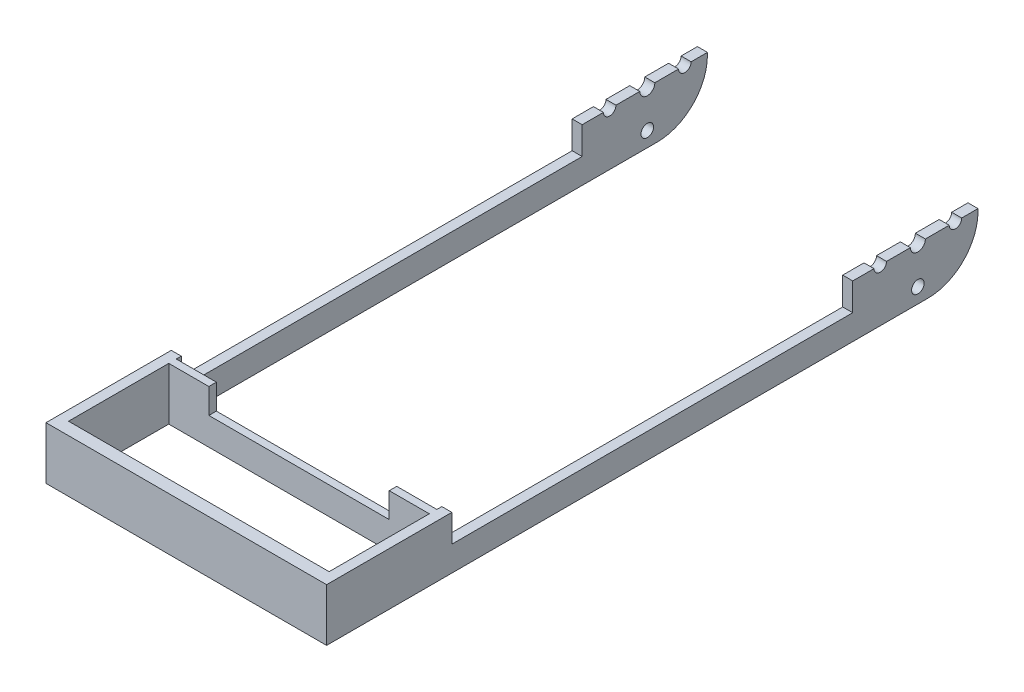
ISO-10303-21;
HEADER;
FILE_DESCRIPTION(('STEP AP214'),'2;1');
FILE_NAME('part.step','',(''),(''),'','','');
FILE_SCHEMA(('AUTOMOTIVE_DESIGN { 1 0 10303 214 1 1 1 1 }'));
ENDSEC;
DATA;
#1=APPLICATION_CONTEXT('core data for automotive mechanical design processes');
#2=APPLICATION_PROTOCOL_DEFINITION('international standard','automotive_design',2000,#1);
#3=PRODUCT_CONTEXT('',#1,'mechanical');
#4=PRODUCT('Part','Part','',(#3));
#5=PRODUCT_RELATED_PRODUCT_CATEGORY('part','',(#4));
#6=PRODUCT_DEFINITION_FORMATION('','',#4);
#7=PRODUCT_DEFINITION_CONTEXT('part definition',#1,'design');
#8=PRODUCT_DEFINITION('design','',#6,#7);
#9=PRODUCT_DEFINITION_SHAPE('','',#8);
#10=(LENGTH_UNIT() NAMED_UNIT(*) SI_UNIT(.MILLI.,.METRE.));
#11=(NAMED_UNIT(*) PLANE_ANGLE_UNIT() SI_UNIT($,.RADIAN.));
#12=(NAMED_UNIT(*) SI_UNIT($,.STERADIAN.) SOLID_ANGLE_UNIT());
#13=UNCERTAINTY_MEASURE_WITH_UNIT(LENGTH_MEASURE(1.E-05),#10,'distance_accuracy_value','');
#14=(GEOMETRIC_REPRESENTATION_CONTEXT(3) GLOBAL_UNCERTAINTY_ASSIGNED_CONTEXT((#13)) GLOBAL_UNIT_ASSIGNED_CONTEXT((#10,
#11,#12)) REPRESENTATION_CONTEXT('',''));
#15=CARTESIAN_POINT('',(0.,0.,0.));
#16=DIRECTION('',(0.,0.,1.));
#17=DIRECTION('',(1.,0.,0.));
#18=AXIS2_PLACEMENT_3D('',#15,#16,#17);
#19=CARTESIAN_POINT('',(0.,0.,0.));
#20=DIRECTION('',(0.,0.,1.));
#21=DIRECTION('',(1.,0.,0.));
#22=AXIS2_PLACEMENT_3D('',#19,#20,#21);
#23=PLANE('',#22);
#24=DIRECTION('',(0.,-1.,0.));
#25=VECTOR('',#24,1.);
#26=CARTESIAN_POINT('',(-28.,10.5,0.));
#27=LINE('',#26,#25);
#28=CARTESIAN_POINT('',(-28.,0.,0.));
#29=VERTEX_POINT('',#28);
#30=CARTESIAN_POINT('',(-28.,-0.499999999999994,0.));
#31=VERTEX_POINT('',#30);
#32=EDGE_CURVE('E309',#29,#31,#27,.T.);
#33=ORIENTED_EDGE('',*,*,#32,.F.);
#34=DIRECTION('',(1.,0.,0.));
#35=VECTOR('',#34,1.);
#36=CARTESIAN_POINT('',(0.,0.,0.));
#37=LINE('',#36,#35);
#38=CARTESIAN_POINT('',(-26.,0.,0.));
#39=VERTEX_POINT('',#38);
#40=EDGE_CURVE('E570',#29,#39,#37,.T.);
#41=ORIENTED_EDGE('',*,*,#40,.T.);
#42=DIRECTION('',(0.,-1.,0.));
#43=VECTOR('',#42,1.);
#44=CARTESIAN_POINT('',(-26.,10.5,0.));
#45=LINE('',#44,#43);
#46=CARTESIAN_POINT('',(-26.,-0.499999999999994,0.));
#47=VERTEX_POINT('',#46);
#48=EDGE_CURVE('E320',#39,#47,#45,.T.);
#49=ORIENTED_EDGE('',*,*,#48,.T.);
#50=DIRECTION('',(1.,0.,0.));
#51=VECTOR('',#50,1.);
#52=CARTESIAN_POINT('',(0.,-0.499999999999997,0.));
#53=LINE('',#52,#51);
#54=EDGE_CURVE('E358',#47,#31,#53,.F.);
#55=ORIENTED_EDGE('',*,*,#54,.T.);
#56=EDGE_LOOP('',(#33,#41,#49,#55));
#57=FACE_BOUND('',#56,.T.);
#58=ADVANCED_FACE('F33',(#57),#23,.F.);
#59=CARTESIAN_POINT('',(28.,10.5,130.));
#60=DIRECTION('',(-1.,0.,0.));
#61=DIRECTION('',(0.,0.,1.));
#62=AXIS2_PLACEMENT_3D('',#59,#60,#61);
#63=PLANE('',#62);
#64=DIRECTION('',(0.,1.,0.));
#65=VECTOR('',#64,1.);
#66=CARTESIAN_POINT('',(28.,10.5,0.));
#67=LINE('',#66,#65);
#68=CARTESIAN_POINT('',(28.,-0.499999999999994,0.));
#69=VERTEX_POINT('',#68);
#70=CARTESIAN_POINT('',(28.,0.,0.));
#71=VERTEX_POINT('',#70);
#72=EDGE_CURVE('E312',#69,#71,#67,.T.);
#73=ORIENTED_EDGE('',*,*,#72,.T.);
#74=DIRECTION('',(0.,0.,-1.));
#75=VECTOR('',#74,1.);
#76=CARTESIAN_POINT('',(28.,0.,-8.32851831252834));
#77=LINE('',#76,#75);
#78=CARTESIAN_POINT('',(28.,0.,3.25));
#79=VERTEX_POINT('',#78);
#80=EDGE_CURVE('E303',#79,#71,#77,.T.);
#81=ORIENTED_EDGE('',*,*,#80,.F.);
#82=CARTESIAN_POINT('',(28.,0.,4.5));
#83=DIRECTION('',(1.,0.,0.));
#84=DIRECTION('',(0.,0.,-1.));
#85=AXIS2_PLACEMENT_3D('',#82,#83,#84);
#86=CIRCLE('',#85,1.25);
#87=CARTESIAN_POINT('',(28.,0.,5.75));
#88=VERTEX_POINT('',#87);
#89=EDGE_CURVE('E447',#88,#79,#86,.T.);
#90=ORIENTED_EDGE('',*,*,#89,.F.);
#91=CARTESIAN_POINT('',(28.,0.,10.5));
#92=VERTEX_POINT('',#91);
#93=EDGE_CURVE('E700',#92,#88,#77,.T.);
#94=ORIENTED_EDGE('',*,*,#93,.F.);
#95=CARTESIAN_POINT('',(28.,0.,12.));
#96=DIRECTION('',(1.,0.,0.));
#97=DIRECTION('',(0.,0.,-1.));
#98=AXIS2_PLACEMENT_3D('',#95,#96,#97);
#99=CIRCLE('',#98,1.5);
#100=CARTESIAN_POINT('',(28.,0.,13.5));
#101=VERTEX_POINT('',#100);
#102=EDGE_CURVE('E446',#101,#92,#99,.T.);
#103=ORIENTED_EDGE('',*,*,#102,.F.);
#104=CARTESIAN_POINT('',(28.,0.,18.25));
#105=VERTEX_POINT('',#104);
#106=EDGE_CURVE('E704',#105,#101,#77,.T.);
#107=ORIENTED_EDGE('',*,*,#106,.F.);
#108=CARTESIAN_POINT('',(28.,0.,19.5));
#109=DIRECTION('',(1.,0.,0.));
#110=DIRECTION('',(0.,0.,1.));
#111=AXIS2_PLACEMENT_3D('',#108,#109,#110);
#112=CIRCLE('',#111,1.25);
#113=CARTESIAN_POINT('',(28.,0.,20.75));
#114=VERTEX_POINT('',#113);
#115=EDGE_CURVE('E440',#114,#105,#112,.T.);
#116=ORIENTED_EDGE('',*,*,#115,.F.);
#117=CARTESIAN_POINT('',(28.,0.,25.));
#118=VERTEX_POINT('',#117);
#119=EDGE_CURVE('E301',#118,#114,#77,.T.);
#120=ORIENTED_EDGE('',*,*,#119,.F.);
#121=DIRECTION('',(0.,1.,0.));
#122=VECTOR('',#121,1.);
#123=CARTESIAN_POINT('',(28.,4.5,25.));
#124=LINE('',#123,#122);
#125=CARTESIAN_POINT('',(28.,-5.5,25.));
#126=VERTEX_POINT('',#125);
#127=EDGE_CURVE('E399',#126,#118,#124,.T.);
#128=ORIENTED_EDGE('',*,*,#127,.F.);
#129=DIRECTION('',(0.,0.,-1.));
#130=VECTOR('',#129,1.);
#131=CARTESIAN_POINT('',(28.,-5.5,105.));
#132=LINE('',#131,#130);
#133=CARTESIAN_POINT('',(28.,-5.5,105.));
#134=VERTEX_POINT('',#133);
#135=EDGE_CURVE('E412',#134,#126,#132,.T.);
#136=ORIENTED_EDGE('',*,*,#135,.F.);
#137=DIRECTION('',(0.,-1.,0.));
#138=VECTOR('',#137,1.);
#139=CARTESIAN_POINT('',(28.,4.5,105.));
#140=LINE('',#139,#138);
#141=CARTESIAN_POINT('',(28.,0.,105.));
#142=VERTEX_POINT('',#141);
#143=EDGE_CURVE('E299',#142,#134,#140,.T.);
#144=ORIENTED_EDGE('',*,*,#143,.F.);
#145=CARTESIAN_POINT('',(28.,0.,130.));
#146=VERTEX_POINT('',#145);
#147=EDGE_CURVE('E280',#146,#142,#77,.T.);
#148=ORIENTED_EDGE('',*,*,#147,.F.);
#149=DIRECTION('',(0.,1.,0.));
#150=VECTOR('',#149,1.);
#151=CARTESIAN_POINT('',(28.,10.5,130.));
#152=LINE('',#151,#150);
#153=CARTESIAN_POINT('',(28.,-10.5,130.));
#154=VERTEX_POINT('',#153);
#155=EDGE_CURVE('E297',#154,#146,#152,.T.);
#156=ORIENTED_EDGE('',*,*,#155,.F.);
#157=DIRECTION('',(0.,0.,-1.));
#158=VECTOR('',#157,1.);
#159=CARTESIAN_POINT('',(28.,-10.5,130.));
#160=LINE('',#159,#158);
#161=CARTESIAN_POINT('',(28.,-10.5,9.99999999999999));
#162=VERTEX_POINT('',#161);
#163=EDGE_CURVE('E319',#154,#162,#160,.T.);
#164=ORIENTED_EDGE('',*,*,#163,.T.);
#165=CARTESIAN_POINT('',(28.,-0.499999999999997,9.99999999999999));
#166=DIRECTION('',(-1.,0.,0.));
#167=DIRECTION('',(0.,0.,1.));
#168=AXIS2_PLACEMENT_3D('',#165,#166,#167);
#169=CIRCLE('',#168,10.);
#170=EDGE_CURVE('E348',#162,#69,#169,.F.);
#171=ORIENTED_EDGE('',*,*,#170,.T.);
#172=EDGE_LOOP('',(#73,#81,#90,#94,#103,#107,#116,#120,#128,#136,#144,#148,#156,#164,#171));
#173=FACE_BOUND('',#172,.T.);
#174=CARTESIAN_POINT('',(28.,-7.5,12.));
#175=DIRECTION('',(1.,0.,0.));
#176=DIRECTION('',(0.,0.,1.));
#177=AXIS2_PLACEMENT_3D('',#174,#175,#176);
#178=CIRCLE('',#177,1.25);
#179=CARTESIAN_POINT('',(28.,-7.5,13.25));
#180=VERTEX_POINT('',#179);
#181=EDGE_CURVE('E436',#180,#180,#178,.T.);
#182=ORIENTED_EDGE('',*,*,#181,.F.);
#183=EDGE_LOOP('',(#182));
#184=FACE_BOUND('',#183,.T.);
#185=ADVANCED_FACE('F294',(#173,#184),#63,.F.);
#186=CARTESIAN_POINT('',(-28.,10.5,130.));
#187=DIRECTION('',(1.,0.,0.));
#188=DIRECTION('',(0.,1.,0.));
#189=AXIS2_PLACEMENT_3D('',#186,#187,#188);
#190=PLANE('',#189);
#191=DIRECTION('',(0.,-1.,0.));
#192=VECTOR('',#191,1.);
#193=CARTESIAN_POINT('',(-28.,10.5,130.));
#194=LINE('',#193,#192);
#195=CARTESIAN_POINT('',(-28.,0.,130.));
#196=VERTEX_POINT('',#195);
#197=CARTESIAN_POINT('',(-28.,-10.5,130.));
#198=VERTEX_POINT('',#197);
#199=EDGE_CURVE('E308',#196,#198,#194,.T.);
#200=ORIENTED_EDGE('',*,*,#199,.F.);
#201=DIRECTION('',(0.,0.,-1.));
#202=VECTOR('',#201,1.);
#203=CARTESIAN_POINT('',(-28.,0.,-9.87498970049028));
#204=LINE('',#203,#202);
#205=CARTESIAN_POINT('',(-28.,0.,105.));
#206=VERTEX_POINT('',#205);
#207=EDGE_CURVE('E283',#196,#206,#204,.T.);
#208=ORIENTED_EDGE('',*,*,#207,.T.);
#209=DIRECTION('',(0.,-1.,0.));
#210=VECTOR('',#209,1.);
#211=CARTESIAN_POINT('',(-28.,4.5,105.));
#212=LINE('',#211,#210);
#213=CARTESIAN_POINT('',(-28.,-5.5,105.));
#214=VERTEX_POINT('',#213);
#215=EDGE_CURVE('E411',#206,#214,#212,.T.);
#216=ORIENTED_EDGE('',*,*,#215,.T.);
#217=DIRECTION('',(0.,0.,-1.));
#218=VECTOR('',#217,1.);
#219=CARTESIAN_POINT('',(-28.,-5.5,105.));
#220=LINE('',#219,#218);
#221=CARTESIAN_POINT('',(-28.,-5.5,25.));
#222=VERTEX_POINT('',#221);
#223=EDGE_CURVE('E414',#214,#222,#220,.T.);
#224=ORIENTED_EDGE('',*,*,#223,.T.);
#225=DIRECTION('',(0.,1.,0.));
#226=VECTOR('',#225,1.);
#227=CARTESIAN_POINT('',(-28.,4.5,25.));
#228=LINE('',#227,#226);
#229=CARTESIAN_POINT('',(-28.,0.,25.));
#230=VERTEX_POINT('',#229);
#231=EDGE_CURVE('E408',#222,#230,#228,.T.);
#232=ORIENTED_EDGE('',*,*,#231,.T.);
#233=CARTESIAN_POINT('',(-28.,0.,20.75));
#234=VERTEX_POINT('',#233);
#235=EDGE_CURVE('E621',#230,#234,#204,.T.);
#236=ORIENTED_EDGE('',*,*,#235,.T.);
#237=CARTESIAN_POINT('',(-28.,0.,19.5));
#238=DIRECTION('',(1.,0.,0.));
#239=DIRECTION('',(0.,0.,1.));
#240=AXIS2_PLACEMENT_3D('',#237,#238,#239);
#241=CIRCLE('',#240,1.25);
#242=CARTESIAN_POINT('',(-28.,0.,18.25));
#243=VERTEX_POINT('',#242);
#244=EDGE_CURVE('E450',#234,#243,#241,.T.);
#245=ORIENTED_EDGE('',*,*,#244,.T.);
#246=CARTESIAN_POINT('',(-28.,0.,13.5));
#247=VERTEX_POINT('',#246);
#248=EDGE_CURVE('E623',#243,#247,#204,.T.);
#249=ORIENTED_EDGE('',*,*,#248,.T.);
#250=CARTESIAN_POINT('',(-28.,0.,12.));
#251=DIRECTION('',(1.,0.,0.));
#252=DIRECTION('',(0.,0.,-1.));
#253=AXIS2_PLACEMENT_3D('',#250,#251,#252);
#254=CIRCLE('',#253,1.5);
#255=CARTESIAN_POINT('',(-28.,0.,10.5));
#256=VERTEX_POINT('',#255);
#257=EDGE_CURVE('E331',#247,#256,#254,.T.);
#258=ORIENTED_EDGE('',*,*,#257,.T.);
#259=CARTESIAN_POINT('',(-28.,0.,5.75));
#260=VERTEX_POINT('',#259);
#261=EDGE_CURVE('E625',#256,#260,#204,.T.);
#262=ORIENTED_EDGE('',*,*,#261,.T.);
#263=CARTESIAN_POINT('',(-28.,0.,4.5));
#264=DIRECTION('',(1.,0.,0.));
#265=DIRECTION('',(0.,0.,-1.));
#266=AXIS2_PLACEMENT_3D('',#263,#264,#265);
#267=CIRCLE('',#266,1.25);
#268=CARTESIAN_POINT('',(-28.,0.,3.25));
#269=VERTEX_POINT('',#268);
#270=EDGE_CURVE('E443',#260,#269,#267,.T.);
#271=ORIENTED_EDGE('',*,*,#270,.T.);
#272=EDGE_CURVE('E300',#269,#29,#204,.T.);
#273=ORIENTED_EDGE('',*,*,#272,.T.);
#274=ORIENTED_EDGE('',*,*,#32,.T.);
#275=CARTESIAN_POINT('',(-28.,-0.499999999999997,9.99999999999999));
#276=DIRECTION('',(1.,0.,0.));
#277=DIRECTION('',(0.,1.,0.));
#278=AXIS2_PLACEMENT_3D('',#275,#276,#277);
#279=CIRCLE('',#278,10.);
#280=CARTESIAN_POINT('',(-28.,-10.5,9.99999999999999));
#281=VERTEX_POINT('',#280);
#282=EDGE_CURVE('E356',#31,#281,#279,.F.);
#283=ORIENTED_EDGE('',*,*,#282,.T.);
#284=DIRECTION('',(0.,0.,-1.));
#285=VECTOR('',#284,1.);
#286=CARTESIAN_POINT('',(-28.,-10.5,130.));
#287=LINE('',#286,#285);
#288=EDGE_CURVE('E323',#198,#281,#287,.T.);
#289=ORIENTED_EDGE('',*,*,#288,.F.);
#290=EDGE_LOOP('',(#200,#208,#216,#224,#232,#236,#245,#249,#258,#262,#271,#273,#274,#283,#289));
#291=FACE_BOUND('',#290,.T.);
#292=CARTESIAN_POINT('',(-28.,-7.5,12.));
#293=DIRECTION('',(1.,0.,0.));
#294=DIRECTION('',(0.,0.,1.));
#295=AXIS2_PLACEMENT_3D('',#292,#293,#294);
#296=CIRCLE('',#295,1.25);
#297=CARTESIAN_POINT('',(-28.,-7.5,13.25));
#298=VERTEX_POINT('',#297);
#299=EDGE_CURVE('E437',#298,#298,#296,.T.);
#300=ORIENTED_EDGE('',*,*,#299,.T.);
#301=EDGE_LOOP('',(#300));
#302=FACE_BOUND('',#301,.T.);
#303=ADVANCED_FACE('F617',(#291,#302),#190,.F.);
#304=CARTESIAN_POINT('',(-28.,-10.5,130.));
#305=DIRECTION('',(0.,1.,0.));
#306=DIRECTION('',(0.,0.,1.));
#307=AXIS2_PLACEMENT_3D('',#304,#305,#306);
#308=PLANE('',#307);
#309=DIRECTION('',(0.,0.,-1.));
#310=VECTOR('',#309,1.);
#311=CARTESIAN_POINT('',(-26.,-10.5,127.5));
#312=LINE('',#311,#310);
#313=CARTESIAN_POINT('',(-26.,-10.5,127.5));
#314=VERTEX_POINT('',#313);
#315=CARTESIAN_POINT('',(-26.,-10.5,107.5));
#316=VERTEX_POINT('',#315);
#317=EDGE_CURVE('E487',#314,#316,#312,.T.);
#318=ORIENTED_EDGE('',*,*,#317,.F.);
#319=DIRECTION('',(-1.,0.,0.));
#320=VECTOR('',#319,1.);
#321=CARTESIAN_POINT('',(26.,-10.5,127.5));
#322=LINE('',#321,#320);
#323=CARTESIAN_POINT('',(26.,-10.5,127.5));
#324=VERTEX_POINT('',#323);
#325=EDGE_CURVE('E467',#324,#314,#322,.T.);
#326=ORIENTED_EDGE('',*,*,#325,.F.);
#327=DIRECTION('',(0.,0.,1.));
#328=VECTOR('',#327,1.);
#329=CARTESIAN_POINT('',(26.,-10.5,107.5));
#330=LINE('',#329,#328);
#331=CARTESIAN_POINT('',(26.,-10.5,107.5));
#332=VERTEX_POINT('',#331);
#333=EDGE_CURVE('E493',#332,#324,#330,.T.);
#334=ORIENTED_EDGE('',*,*,#333,.F.);
#335=DIRECTION('',(1.,0.,0.));
#336=VECTOR('',#335,1.);
#337=CARTESIAN_POINT('',(-26.,-10.5,107.5));
#338=LINE('',#337,#336);
#339=EDGE_CURVE('E490',#316,#332,#338,.T.);
#340=ORIENTED_EDGE('',*,*,#339,.F.);
#341=EDGE_LOOP('',(#318,#326,#334,#340));
#342=FACE_BOUND('',#341,.T.);
#343=DIRECTION('',(0.,0.,1.));
#344=VECTOR('',#343,1.);
#345=CARTESIAN_POINT('',(26.,-10.5,0.));
#346=LINE('',#345,#344);
#347=CARTESIAN_POINT('',(26.,-10.5,9.99999999999999));
#348=VERTEX_POINT('',#347);
#349=CARTESIAN_POINT('',(26.,-10.5,106.));
#350=VERTEX_POINT('',#349);
#351=EDGE_CURVE('E468',#348,#350,#346,.T.);
#352=ORIENTED_EDGE('',*,*,#351,.F.);
#353=DIRECTION('',(1.,0.,0.));
#354=VECTOR('',#353,1.);
#355=CARTESIAN_POINT('',(-28.,-10.5,9.99999999999999));
#356=LINE('',#355,#354);
#357=EDGE_CURVE('E353',#348,#162,#356,.T.);
#358=ORIENTED_EDGE('',*,*,#357,.T.);
#359=ORIENTED_EDGE('',*,*,#163,.F.);
#360=DIRECTION('',(1.,0.,0.));
#361=VECTOR('',#360,1.);
#362=CARTESIAN_POINT('',(-28.,-10.5,130.));
#363=LINE('',#362,#361);
#364=EDGE_CURVE('E306',#198,#154,#363,.T.);
#365=ORIENTED_EDGE('',*,*,#364,.F.);
#366=ORIENTED_EDGE('',*,*,#288,.T.);
#367=DIRECTION('',(1.,0.,0.));
#368=VECTOR('',#367,1.);
#369=CARTESIAN_POINT('',(-28.,-10.5,9.99999999999999));
#370=LINE('',#369,#368);
#371=CARTESIAN_POINT('',(-26.,-10.5,9.99999999999999));
#372=VERTEX_POINT('',#371);
#373=EDGE_CURVE('E350',#281,#372,#370,.T.);
#374=ORIENTED_EDGE('',*,*,#373,.T.);
#375=DIRECTION('',(0.,0.,-1.));
#376=VECTOR('',#375,1.);
#377=CARTESIAN_POINT('',(-26.,-10.5,106.));
#378=LINE('',#377,#376);
#379=CARTESIAN_POINT('',(-26.,-10.5,106.));
#380=VERTEX_POINT('',#379);
#381=EDGE_CURVE('E475',#380,#372,#378,.T.);
#382=ORIENTED_EDGE('',*,*,#381,.F.);
#383=DIRECTION('',(-1.,0.,0.));
#384=VECTOR('',#383,1.);
#385=CARTESIAN_POINT('',(-26.,-10.5,106.));
#386=LINE('',#385,#384);
#387=EDGE_CURVE('E471',#350,#380,#386,.T.);
#388=ORIENTED_EDGE('',*,*,#387,.F.);
#389=EDGE_LOOP('',(#352,#358,#359,#365,#366,#374,#382,#388));
#390=FACE_BOUND('',#389,.T.);
#391=ADVANCED_FACE('F513',(#342,#390),#308,.F.);
#392=CARTESIAN_POINT('',(0.,0.,130.));
#393=DIRECTION('',(0.,0.,1.));
#394=DIRECTION('',(1.,0.,0.));
#395=AXIS2_PLACEMENT_3D('',#392,#393,#394);
#396=PLANE('',#395);
#397=DIRECTION('',(1.,0.,0.));
#398=VECTOR('',#397,1.);
#399=CARTESIAN_POINT('',(0.,0.,130.));
#400=LINE('',#399,#398);
#401=EDGE_CURVE('E277',#196,#146,#400,.T.);
#402=ORIENTED_EDGE('',*,*,#401,.F.);
#403=ORIENTED_EDGE('',*,*,#199,.T.);
#404=ORIENTED_EDGE('',*,*,#364,.T.);
#405=ORIENTED_EDGE('',*,*,#155,.T.);
#406=EDGE_LOOP('',(#402,#403,#404,#405));
#407=FACE_BOUND('',#406,.T.);
#408=ADVANCED_FACE('F304',(#407),#396,.T.);
#409=DIRECTION('',(0.,-1.,0.));
#410=VECTOR('',#409,1.);
#411=CARTESIAN_POINT('',(26.,10.5,0.));
#412=LINE('',#411,#410);
#413=CARTESIAN_POINT('',(26.,0.,0.));
#414=VERTEX_POINT('',#413);
#415=CARTESIAN_POINT('',(26.,-0.499999999999994,0.));
#416=VERTEX_POINT('',#415);
#417=EDGE_CURVE('E478',#414,#416,#412,.T.);
#418=ORIENTED_EDGE('',*,*,#417,.F.);
#419=DIRECTION('',(1.,0.,0.));
#420=VECTOR('',#419,1.);
#421=CARTESIAN_POINT('',(0.,0.,0.));
#422=LINE('',#421,#420);
#423=EDGE_CURVE('E588',#414,#71,#422,.T.);
#424=ORIENTED_EDGE('',*,*,#423,.T.);
#425=ORIENTED_EDGE('',*,*,#72,.F.);
#426=DIRECTION('',(1.,0.,0.));
#427=VECTOR('',#426,1.);
#428=CARTESIAN_POINT('',(0.,-0.499999999999997,0.));
#429=LINE('',#428,#427);
#430=EDGE_CURVE('E345',#69,#416,#429,.F.);
#431=ORIENTED_EDGE('',*,*,#430,.T.);
#432=EDGE_LOOP('',(#418,#424,#425,#431));
#433=FACE_BOUND('',#432,.T.);
#434=ADVANCED_FACE('F666',(#433),#23,.F.);
#435=CARTESIAN_POINT('',(-26.,10.5,106.));
#436=DIRECTION('',(-1.,0.,0.));
#437=DIRECTION('',(0.,0.,1.));
#438=AXIS2_PLACEMENT_3D('',#435,#436,#437);
#439=PLANE('',#438);
#440=ORIENTED_EDGE('',*,*,#48,.F.);
#441=DIRECTION('',(0.,0.,1.));
#442=VECTOR('',#441,1.);
#443=CARTESIAN_POINT('',(-26.,0.,106.));
#444=LINE('',#443,#442);
#445=CARTESIAN_POINT('',(-26.,0.,3.25));
#446=VERTEX_POINT('',#445);
#447=EDGE_CURVE('E569',#39,#446,#444,.T.);
#448=ORIENTED_EDGE('',*,*,#447,.T.);
#449=CARTESIAN_POINT('',(-26.,0.,4.5));
#450=DIRECTION('',(-1.,0.,0.));
#451=DIRECTION('',(0.,0.,1.));
#452=AXIS2_PLACEMENT_3D('',#449,#450,#451);
#453=CIRCLE('',#452,1.25);
#454=CARTESIAN_POINT('',(-26.,0.,5.75));
#455=VERTEX_POINT('',#454);
#456=EDGE_CURVE('E343',#446,#455,#453,.T.);
#457=ORIENTED_EDGE('',*,*,#456,.T.);
#458=CARTESIAN_POINT('',(-26.,0.,10.5));
#459=VERTEX_POINT('',#458);
#460=EDGE_CURVE('E562',#455,#459,#444,.T.);
#461=ORIENTED_EDGE('',*,*,#460,.T.);
#462=CARTESIAN_POINT('',(-26.,0.,12.));
#463=DIRECTION('',(-1.,0.,0.));
#464=DIRECTION('',(0.,0.,1.));
#465=AXIS2_PLACEMENT_3D('',#462,#463,#464);
#466=CIRCLE('',#465,1.5);
#467=CARTESIAN_POINT('',(-26.,0.,13.5));
#468=VERTEX_POINT('',#467);
#469=EDGE_CURVE('E330',#459,#468,#466,.T.);
#470=ORIENTED_EDGE('',*,*,#469,.T.);
#471=CARTESIAN_POINT('',(-26.,0.,18.25));
#472=VERTEX_POINT('',#471);
#473=EDGE_CURVE('E543',#468,#472,#444,.T.);
#474=ORIENTED_EDGE('',*,*,#473,.T.);
#475=CARTESIAN_POINT('',(-26.,0.,19.5));
#476=DIRECTION('',(-1.,0.,0.));
#477=DIRECTION('',(0.,0.,1.));
#478=AXIS2_PLACEMENT_3D('',#475,#476,#477);
#479=CIRCLE('',#478,1.25);
#480=CARTESIAN_POINT('',(-26.,0.,20.75));
#481=VERTEX_POINT('',#480);
#482=EDGE_CURVE('E339',#472,#481,#479,.T.);
#483=ORIENTED_EDGE('',*,*,#482,.T.);
#484=CARTESIAN_POINT('',(-26.,0.,25.));
#485=VERTEX_POINT('',#484);
#486=EDGE_CURVE('E544',#481,#485,#444,.T.);
#487=ORIENTED_EDGE('',*,*,#486,.T.);
#488=DIRECTION('',(0.,-1.,0.));
#489=VECTOR('',#488,1.);
#490=CARTESIAN_POINT('',(-26.,10.5,25.));
#491=LINE('',#490,#489);
#492=CARTESIAN_POINT('',(-26.,-5.5,25.));
#493=VERTEX_POINT('',#492);
#494=EDGE_CURVE('E434',#485,#493,#491,.T.);
#495=ORIENTED_EDGE('',*,*,#494,.T.);
#496=DIRECTION('',(0.,0.,1.));
#497=VECTOR('',#496,1.);
#498=CARTESIAN_POINT('',(-26.,-5.5,106.));
#499=LINE('',#498,#497);
#500=CARTESIAN_POINT('',(-26.,-5.5,105.));
#501=VERTEX_POINT('',#500);
#502=EDGE_CURVE('E431',#493,#501,#499,.T.);
#503=ORIENTED_EDGE('',*,*,#502,.T.);
#504=DIRECTION('',(0.,1.,0.));
#505=VECTOR('',#504,1.);
#506=CARTESIAN_POINT('',(-26.,10.5,105.));
#507=LINE('',#506,#505);
#508=CARTESIAN_POINT('',(-26.,0.,105.));
#509=VERTEX_POINT('',#508);
#510=EDGE_CURVE('E424',#501,#509,#507,.T.);
#511=ORIENTED_EDGE('',*,*,#510,.T.);
#512=CARTESIAN_POINT('',(-26.,0.,106.));
#513=VERTEX_POINT('',#512);
#514=EDGE_CURVE('E539',#509,#513,#444,.T.);
#515=ORIENTED_EDGE('',*,*,#514,.T.);
#516=DIRECTION('',(0.,-1.,0.));
#517=VECTOR('',#516,1.);
#518=CARTESIAN_POINT('',(-26.,10.5,106.));
#519=LINE('',#518,#517);
#520=EDGE_CURVE('E480',#513,#380,#519,.T.);
#521=ORIENTED_EDGE('',*,*,#520,.T.);
#522=ORIENTED_EDGE('',*,*,#381,.T.);
#523=CARTESIAN_POINT('',(-26.,-0.499999999999997,9.99999999999999));
#524=DIRECTION('',(-1.,0.,0.));
#525=DIRECTION('',(0.,0.,1.));
#526=AXIS2_PLACEMENT_3D('',#523,#524,#525);
#527=CIRCLE('',#526,10.);
#528=EDGE_CURVE('E361',#372,#47,#527,.F.);
#529=ORIENTED_EDGE('',*,*,#528,.T.);
#530=EDGE_LOOP('',(#440,#448,#457,#461,#470,#474,#483,#487,#495,#503,#511,#515,#521,#522,#529));
#531=FACE_BOUND('',#530,.T.);
#532=CARTESIAN_POINT('',(-26.,-7.5,12.));
#533=DIRECTION('',(-1.,0.,0.));
#534=DIRECTION('',(0.,0.,1.));
#535=AXIS2_PLACEMENT_3D('',#532,#533,#534);
#536=CIRCLE('',#535,1.25);
#537=CARTESIAN_POINT('',(-26.,-7.5,13.25));
#538=VERTEX_POINT('',#537);
#539=EDGE_CURVE('E335',#538,#538,#536,.T.);
#540=ORIENTED_EDGE('',*,*,#539,.T.);
#541=EDGE_LOOP('',(#540));
#542=FACE_BOUND('',#541,.T.);
#543=ADVANCED_FACE('F605',(#531,#542),#439,.F.);
#544=CARTESIAN_POINT('',(-26.,10.5,106.));
#545=DIRECTION('',(0.,0.,1.));
#546=DIRECTION('',(1.,0.,0.));
#547=AXIS2_PLACEMENT_3D('',#544,#545,#546);
#548=PLANE('',#547);
#549=ORIENTED_EDGE('',*,*,#520,.F.);
#550=DIRECTION('',(1.,0.,0.));
#551=VECTOR('',#550,1.);
#552=CARTESIAN_POINT('',(-26.,0.,106.));
#553=LINE('',#552,#551);
#554=CARTESIAN_POINT('',(-18.,0.,106.));
#555=VERTEX_POINT('',#554);
#556=EDGE_CURVE('E530',#513,#555,#553,.T.);
#557=ORIENTED_EDGE('',*,*,#556,.T.);
#558=DIRECTION('',(0.,1.,0.));
#559=VECTOR('',#558,1.);
#560=CARTESIAN_POINT('',(-18.,5.,106.));
#561=LINE('',#560,#559);
#562=CARTESIAN_POINT('',(-18.,-5.,106.));
#563=VERTEX_POINT('',#562);
#564=EDGE_CURVE('E287',#563,#555,#561,.T.);
#565=ORIENTED_EDGE('',*,*,#564,.F.);
#566=DIRECTION('',(-1.,0.,0.));
#567=VECTOR('',#566,1.);
#568=CARTESIAN_POINT('',(18.,-5.,106.));
#569=LINE('',#568,#567);
#570=CARTESIAN_POINT('',(18.,-5.,106.));
#571=VERTEX_POINT('',#570);
#572=EDGE_CURVE('E397',#571,#563,#569,.T.);
#573=ORIENTED_EDGE('',*,*,#572,.F.);
#574=DIRECTION('',(0.,-1.,0.));
#575=VECTOR('',#574,1.);
#576=CARTESIAN_POINT('',(18.,5.,106.));
#577=LINE('',#576,#575);
#578=CARTESIAN_POINT('',(18.,0.,106.));
#579=VERTEX_POINT('',#578);
#580=EDGE_CURVE('E595',#579,#571,#577,.T.);
#581=ORIENTED_EDGE('',*,*,#580,.F.);
#582=CARTESIAN_POINT('',(26.,0.,106.));
#583=VERTEX_POINT('',#582);
#584=EDGE_CURVE('E524',#579,#583,#553,.T.);
#585=ORIENTED_EDGE('',*,*,#584,.T.);
#586=DIRECTION('',(0.,-1.,0.));
#587=VECTOR('',#586,1.);
#588=CARTESIAN_POINT('',(26.,10.5,106.));
#589=LINE('',#588,#587);
#590=EDGE_CURVE('E482',#583,#350,#589,.T.);
#591=ORIENTED_EDGE('',*,*,#590,.T.);
#592=ORIENTED_EDGE('',*,*,#387,.T.);
#593=EDGE_LOOP('',(#549,#557,#565,#573,#581,#585,#591,#592));
#594=FACE_BOUND('',#593,.T.);
#595=ADVANCED_FACE('F601',(#594),#548,.F.);
#596=CARTESIAN_POINT('',(26.,10.5,0.));
#597=DIRECTION('',(1.,0.,0.));
#598=DIRECTION('',(0.,0.,-1.));
#599=AXIS2_PLACEMENT_3D('',#596,#597,#598);
#600=PLANE('',#599);
#601=ORIENTED_EDGE('',*,*,#590,.F.);
#602=DIRECTION('',(0.,0.,-1.));
#603=VECTOR('',#602,1.);
#604=CARTESIAN_POINT('',(26.,0.,0.));
#605=LINE('',#604,#603);
#606=CARTESIAN_POINT('',(26.,0.,105.));
#607=VERTEX_POINT('',#606);
#608=EDGE_CURVE('E532',#583,#607,#605,.T.);
#609=ORIENTED_EDGE('',*,*,#608,.T.);
#610=DIRECTION('',(0.,-1.,0.));
#611=VECTOR('',#610,1.);
#612=CARTESIAN_POINT('',(26.,10.5,105.));
#613=LINE('',#612,#611);
#614=CARTESIAN_POINT('',(26.,-5.5,105.));
#615=VERTEX_POINT('',#614);
#616=EDGE_CURVE('E364',#607,#615,#613,.T.);
#617=ORIENTED_EDGE('',*,*,#616,.T.);
#618=DIRECTION('',(0.,0.,-1.));
#619=VECTOR('',#618,1.);
#620=CARTESIAN_POINT('',(26.,-5.5,0.));
#621=LINE('',#620,#619);
#622=CARTESIAN_POINT('',(26.,-5.5,25.));
#623=VERTEX_POINT('',#622);
#624=EDGE_CURVE('E366',#615,#623,#621,.T.);
#625=ORIENTED_EDGE('',*,*,#624,.T.);
#626=DIRECTION('',(0.,1.,0.));
#627=VECTOR('',#626,1.);
#628=CARTESIAN_POINT('',(26.,10.5,25.));
#629=LINE('',#628,#627);
#630=CARTESIAN_POINT('',(26.,0.,25.));
#631=VERTEX_POINT('',#630);
#632=EDGE_CURVE('E369',#623,#631,#629,.T.);
#633=ORIENTED_EDGE('',*,*,#632,.T.);
#634=CARTESIAN_POINT('',(26.,0.,20.75));
#635=VERTEX_POINT('',#634);
#636=EDGE_CURVE('E535',#631,#635,#605,.T.);
#637=ORIENTED_EDGE('',*,*,#636,.T.);
#638=CARTESIAN_POINT('',(26.,0.,19.5));
#639=DIRECTION('',(1.,0.,0.));
#640=DIRECTION('',(0.,0.,-1.));
#641=AXIS2_PLACEMENT_3D('',#638,#639,#640);
#642=CIRCLE('',#641,1.25);
#643=CARTESIAN_POINT('',(26.,0.,18.25));
#644=VERTEX_POINT('',#643);
#645=EDGE_CURVE('E336',#635,#644,#642,.T.);
#646=ORIENTED_EDGE('',*,*,#645,.T.);
#647=CARTESIAN_POINT('',(26.,0.,13.5));
#648=VERTEX_POINT('',#647);
#649=EDGE_CURVE('E48',#644,#648,#605,.T.);
#650=ORIENTED_EDGE('',*,*,#649,.T.);
#651=CARTESIAN_POINT('',(26.,0.,12.));
#652=DIRECTION('',(1.,0.,0.));
#653=DIRECTION('',(0.,0.,-1.));
#654=AXIS2_PLACEMENT_3D('',#651,#652,#653);
#655=CIRCLE('',#654,1.5);
#656=CARTESIAN_POINT('',(26.,0.,10.5));
#657=VERTEX_POINT('',#656);
#658=EDGE_CURVE('E327',#648,#657,#655,.T.);
#659=ORIENTED_EDGE('',*,*,#658,.T.);
#660=CARTESIAN_POINT('',(26.,0.,5.75));
#661=VERTEX_POINT('',#660);
#662=EDGE_CURVE('E582',#657,#661,#605,.T.);
#663=ORIENTED_EDGE('',*,*,#662,.T.);
#664=CARTESIAN_POINT('',(26.,0.,4.5));
#665=DIRECTION('',(1.,0.,0.));
#666=DIRECTION('',(0.,0.,-1.));
#667=AXIS2_PLACEMENT_3D('',#664,#665,#666);
#668=CIRCLE('',#667,1.25);
#669=CARTESIAN_POINT('',(26.,0.,3.25));
#670=VERTEX_POINT('',#669);
#671=EDGE_CURVE('E340',#661,#670,#668,.T.);
#672=ORIENTED_EDGE('',*,*,#671,.T.);
#673=EDGE_CURVE('E56',#670,#414,#605,.T.);
#674=ORIENTED_EDGE('',*,*,#673,.T.);
#675=ORIENTED_EDGE('',*,*,#417,.T.);
#676=CARTESIAN_POINT('',(26.,-0.499999999999997,9.99999999999999));
#677=DIRECTION('',(1.,0.,0.));
#678=DIRECTION('',(0.,0.,-1.));
#679=AXIS2_PLACEMENT_3D('',#676,#677,#678);
#680=CIRCLE('',#679,10.);
#681=EDGE_CURVE('E326',#416,#348,#680,.F.);
#682=ORIENTED_EDGE('',*,*,#681,.T.);
#683=ORIENTED_EDGE('',*,*,#351,.T.);
#684=EDGE_LOOP('',(#601,#609,#617,#625,#633,#637,#646,#650,#659,#663,#672,#674,#675,#682,#683));
#685=FACE_BOUND('',#684,.T.);
#686=CARTESIAN_POINT('',(26.,-7.5,12.));
#687=DIRECTION('',(1.,0.,0.));
#688=DIRECTION('',(0.,0.,-1.));
#689=AXIS2_PLACEMENT_3D('',#686,#687,#688);
#690=CIRCLE('',#689,1.25);
#691=CARTESIAN_POINT('',(26.,-7.5,10.75));
#692=VERTEX_POINT('',#691);
#693=EDGE_CURVE('E332',#692,#692,#690,.T.);
#694=ORIENTED_EDGE('',*,*,#693,.T.);
#695=EDGE_LOOP('',(#694));
#696=FACE_BOUND('',#695,.T.);
#697=ADVANCED_FACE('F686',(#685,#696),#600,.F.);
#698=CARTESIAN_POINT('',(26.,10.5,127.5));
#699=DIRECTION('',(0.,0.,1.));
#700=DIRECTION('',(1.,0.,0.));
#701=AXIS2_PLACEMENT_3D('',#698,#699,#700);
#702=PLANE('',#701);
#703=DIRECTION('',(0.,-1.,0.));
#704=VECTOR('',#703,1.);
#705=CARTESIAN_POINT('',(-26.,10.5,127.5));
#706=LINE('',#705,#704);
#707=CARTESIAN_POINT('',(-26.,0.,127.5));
#708=VERTEX_POINT('',#707);
#709=EDGE_CURVE('E315',#708,#314,#706,.T.);
#710=ORIENTED_EDGE('',*,*,#709,.F.);
#711=DIRECTION('',(1.,0.,0.));
#712=VECTOR('',#711,1.);
#713=CARTESIAN_POINT('',(26.,0.,127.5));
#714=LINE('',#713,#712);
#715=CARTESIAN_POINT('',(26.,0.,127.5));
#716=VERTEX_POINT('',#715);
#717=EDGE_CURVE('E522',#708,#716,#714,.T.);
#718=ORIENTED_EDGE('',*,*,#717,.T.);
#719=DIRECTION('',(0.,-1.,0.));
#720=VECTOR('',#719,1.);
#721=CARTESIAN_POINT('',(26.,10.5,127.5));
#722=LINE('',#721,#720);
#723=EDGE_CURVE('E472',#716,#324,#722,.T.);
#724=ORIENTED_EDGE('',*,*,#723,.T.);
#725=ORIENTED_EDGE('',*,*,#325,.T.);
#726=EDGE_LOOP('',(#710,#718,#724,#725));
#727=FACE_BOUND('',#726,.T.);
#728=ADVANCED_FACE('F509',(#727),#702,.F.);
#729=CARTESIAN_POINT('',(26.,10.5,107.5));
#730=DIRECTION('',(1.,0.,0.));
#731=DIRECTION('',(0.,0.,-1.));
#732=AXIS2_PLACEMENT_3D('',#729,#730,#731);
#733=PLANE('',#732);
#734=ORIENTED_EDGE('',*,*,#723,.F.);
#735=DIRECTION('',(0.,0.,-1.));
#736=VECTOR('',#735,1.);
#737=CARTESIAN_POINT('',(26.,0.,107.5));
#738=LINE('',#737,#736);
#739=CARTESIAN_POINT('',(26.,0.,107.5));
#740=VERTEX_POINT('',#739);
#741=EDGE_CURVE('E521',#716,#740,#738,.T.);
#742=ORIENTED_EDGE('',*,*,#741,.T.);
#743=DIRECTION('',(0.,-1.,0.));
#744=VECTOR('',#743,1.);
#745=CARTESIAN_POINT('',(26.,10.5,107.5));
#746=LINE('',#745,#744);
#747=EDGE_CURVE('E497',#740,#332,#746,.T.);
#748=ORIENTED_EDGE('',*,*,#747,.T.);
#749=ORIENTED_EDGE('',*,*,#333,.T.);
#750=EDGE_LOOP('',(#734,#742,#748,#749));
#751=FACE_BOUND('',#750,.T.);
#752=ADVANCED_FACE('F520',(#751),#733,.F.);
#753=CARTESIAN_POINT('',(-26.,10.5,107.5));
#754=DIRECTION('',(0.,0.,-1.));
#755=DIRECTION('',(-1.,0.,0.));
#756=AXIS2_PLACEMENT_3D('',#753,#754,#755);
#757=PLANE('',#756);
#758=ORIENTED_EDGE('',*,*,#747,.F.);
#759=DIRECTION('',(-1.,0.,0.));
#760=VECTOR('',#759,1.);
#761=CARTESIAN_POINT('',(-26.,0.,107.5));
#762=LINE('',#761,#760);
#763=CARTESIAN_POINT('',(18.,0.,107.5));
#764=VERTEX_POINT('',#763);
#765=EDGE_CURVE('E516',#740,#764,#762,.T.);
#766=ORIENTED_EDGE('',*,*,#765,.T.);
#767=DIRECTION('',(0.,-1.,0.));
#768=VECTOR('',#767,1.);
#769=CARTESIAN_POINT('',(18.,10.5,107.5));
#770=LINE('',#769,#768);
#771=CARTESIAN_POINT('',(18.,-5.,107.5));
#772=VERTEX_POINT('',#771);
#773=EDGE_CURVE('E372',#764,#772,#770,.T.);
#774=ORIENTED_EDGE('',*,*,#773,.T.);
#775=DIRECTION('',(-1.,0.,0.));
#776=VECTOR('',#775,1.);
#777=CARTESIAN_POINT('',(-26.,-5.,107.5));
#778=LINE('',#777,#776);
#779=CARTESIAN_POINT('',(-18.,-5.,107.5));
#780=VERTEX_POINT('',#779);
#781=EDGE_CURVE('E374',#772,#780,#778,.T.);
#782=ORIENTED_EDGE('',*,*,#781,.T.);
#783=DIRECTION('',(0.,1.,0.));
#784=VECTOR('',#783,1.);
#785=CARTESIAN_POINT('',(-18.,10.5,107.5));
#786=LINE('',#785,#784);
#787=CARTESIAN_POINT('',(-18.,0.,107.5));
#788=VERTEX_POINT('',#787);
#789=EDGE_CURVE('E41',#780,#788,#786,.T.);
#790=ORIENTED_EDGE('',*,*,#789,.T.);
#791=CARTESIAN_POINT('',(-26.,0.,107.5));
#792=VERTEX_POINT('',#791);
#793=EDGE_CURVE('E381',#788,#792,#762,.T.);
#794=ORIENTED_EDGE('',*,*,#793,.T.);
#795=DIRECTION('',(0.,-1.,0.));
#796=VECTOR('',#795,1.);
#797=CARTESIAN_POINT('',(-26.,10.5,107.5));
#798=LINE('',#797,#796);
#799=EDGE_CURVE('E498',#792,#316,#798,.T.);
#800=ORIENTED_EDGE('',*,*,#799,.T.);
#801=ORIENTED_EDGE('',*,*,#339,.T.);
#802=EDGE_LOOP('',(#758,#766,#774,#782,#790,#794,#800,#801));
#803=FACE_BOUND('',#802,.T.);
#804=ADVANCED_FACE('F380',(#803),#757,.F.);
#805=CARTESIAN_POINT('',(-26.,10.5,127.5));
#806=DIRECTION('',(-1.,0.,0.));
#807=DIRECTION('',(0.,0.,1.));
#808=AXIS2_PLACEMENT_3D('',#805,#806,#807);
#809=PLANE('',#808);
#810=ORIENTED_EDGE('',*,*,#799,.F.);
#811=DIRECTION('',(0.,0.,1.));
#812=VECTOR('',#811,1.);
#813=CARTESIAN_POINT('',(-26.,0.,127.5));
#814=LINE('',#813,#812);
#815=EDGE_CURVE('E505',#792,#708,#814,.T.);
#816=ORIENTED_EDGE('',*,*,#815,.T.);
#817=ORIENTED_EDGE('',*,*,#709,.T.);
#818=ORIENTED_EDGE('',*,*,#317,.T.);
#819=EDGE_LOOP('',(#810,#816,#817,#818));
#820=FACE_BOUND('',#819,.T.);
#821=ADVANCED_FACE('F502',(#820),#809,.F.);
#822=CARTESIAN_POINT('',(-28.,0.,12.));
#823=DIRECTION('',(1.,0.,0.));
#824=DIRECTION('',(0.,0.,-1.));
#825=AXIS2_PLACEMENT_3D('',#822,#823,#824);
#826=CYLINDRICAL_SURFACE('',#825,1.5);
#827=ORIENTED_EDGE('',*,*,#102,.T.);
#828=DIRECTION('',(1.,0.,0.));
#829=VECTOR('',#828,1.);
#830=CARTESIAN_POINT('',(-28.,0.,10.5));
#831=LINE('',#830,#829);
#832=EDGE_CURVE('E583',#92,#657,#831,.F.);
#833=ORIENTED_EDGE('',*,*,#832,.T.);
#834=ORIENTED_EDGE('',*,*,#658,.F.);
#835=DIRECTION('',(1.,0.,0.));
#836=VECTOR('',#835,1.);
#837=CARTESIAN_POINT('',(-28.,0.,13.5));
#838=LINE('',#837,#836);
#839=EDGE_CURVE('E288',#648,#101,#838,.T.);
#840=ORIENTED_EDGE('',*,*,#839,.T.);
#841=EDGE_LOOP('',(#827,#833,#834,#840));
#842=FACE_BOUND('',#841,.T.);
#843=ADVANCED_FACE('F695',(#842),#826,.F.);
#844=CARTESIAN_POINT('',(-28.,-7.5,12.));
#845=DIRECTION('',(1.,0.,0.));
#846=DIRECTION('',(0.,0.,-1.));
#847=AXIS2_PLACEMENT_3D('',#844,#845,#846);
#848=CYLINDRICAL_SURFACE('',#847,1.25);
#849=ORIENTED_EDGE('',*,*,#181,.T.);
#850=EDGE_LOOP('',(#849));
#851=FACE_BOUND('',#850,.T.);
#852=ORIENTED_EDGE('',*,*,#693,.F.);
#853=EDGE_LOOP('',(#852));
#854=FACE_BOUND('',#853,.T.);
#855=ADVANCED_FACE('F718',(#851,#854),#848,.F.);
#856=CARTESIAN_POINT('',(-28.,0.,19.5));
#857=DIRECTION('',(1.,0.,0.));
#858=DIRECTION('',(0.,0.,-1.));
#859=AXIS2_PLACEMENT_3D('',#856,#857,#858);
#860=CYLINDRICAL_SURFACE('',#859,1.25);
#861=ORIENTED_EDGE('',*,*,#115,.T.);
#862=DIRECTION('',(1.,0.,0.));
#863=VECTOR('',#862,1.);
#864=CARTESIAN_POINT('',(-28.,0.,18.25));
#865=LINE('',#864,#863);
#866=EDGE_CURVE('E591',#105,#644,#865,.F.);
#867=ORIENTED_EDGE('',*,*,#866,.T.);
#868=ORIENTED_EDGE('',*,*,#645,.F.);
#869=DIRECTION('',(1.,0.,0.));
#870=VECTOR('',#869,1.);
#871=CARTESIAN_POINT('',(-28.,0.,20.75));
#872=LINE('',#871,#870);
#873=EDGE_CURVE('E556',#635,#114,#872,.T.);
#874=ORIENTED_EDGE('',*,*,#873,.T.);
#875=EDGE_LOOP('',(#861,#867,#868,#874));
#876=FACE_BOUND('',#875,.T.);
#877=ADVANCED_FACE('F709',(#876),#860,.F.);
#878=CARTESIAN_POINT('',(-28.,0.,4.5));
#879=DIRECTION('',(1.,0.,0.));
#880=DIRECTION('',(0.,0.,-1.));
#881=AXIS2_PLACEMENT_3D('',#878,#879,#880);
#882=CYLINDRICAL_SURFACE('',#881,1.25);
#883=ORIENTED_EDGE('',*,*,#89,.T.);
#884=DIRECTION('',(1.,0.,0.));
#885=VECTOR('',#884,1.);
#886=CARTESIAN_POINT('',(-28.,0.,3.25));
#887=LINE('',#886,#885);
#888=EDGE_CURVE('E586',#79,#670,#887,.F.);
#889=ORIENTED_EDGE('',*,*,#888,.T.);
#890=ORIENTED_EDGE('',*,*,#671,.F.);
#891=DIRECTION('',(1.,0.,0.));
#892=VECTOR('',#891,1.);
#893=CARTESIAN_POINT('',(-28.,0.,5.75));
#894=LINE('',#893,#892);
#895=EDGE_CURVE('E579',#661,#88,#894,.T.);
#896=ORIENTED_EDGE('',*,*,#895,.T.);
#897=EDGE_LOOP('',(#883,#889,#890,#896));
#898=FACE_BOUND('',#897,.T.);
#899=ADVANCED_FACE('F707',(#898),#882,.F.);
#900=ORIENTED_EDGE('',*,*,#469,.F.);
#901=DIRECTION('',(1.,0.,0.));
#902=VECTOR('',#901,1.);
#903=CARTESIAN_POINT('',(-28.,0.,10.5));
#904=LINE('',#903,#902);
#905=EDGE_CURVE('E563',#459,#256,#904,.F.);
#906=ORIENTED_EDGE('',*,*,#905,.T.);
#907=ORIENTED_EDGE('',*,*,#257,.F.);
#908=DIRECTION('',(1.,0.,0.));
#909=VECTOR('',#908,1.);
#910=CARTESIAN_POINT('',(-28.,0.,13.5));
#911=LINE('',#910,#909);
#912=EDGE_CURVE('E576',#247,#468,#911,.T.);
#913=ORIENTED_EDGE('',*,*,#912,.T.);
#914=EDGE_LOOP('',(#900,#906,#907,#913));
#915=FACE_BOUND('',#914,.T.);
#916=ADVANCED_FACE('F635',(#915),#826,.F.);
#917=ORIENTED_EDGE('',*,*,#299,.F.);
#918=EDGE_LOOP('',(#917));
#919=FACE_BOUND('',#918,.T.);
#920=ORIENTED_EDGE('',*,*,#539,.F.);
#921=EDGE_LOOP('',(#920));
#922=FACE_BOUND('',#921,.T.);
#923=ADVANCED_FACE('F716',(#919,#922),#848,.F.);
#924=ORIENTED_EDGE('',*,*,#482,.F.);
#925=DIRECTION('',(1.,0.,0.));
#926=VECTOR('',#925,1.);
#927=CARTESIAN_POINT('',(-28.,0.,18.25));
#928=LINE('',#927,#926);
#929=EDGE_CURVE('E573',#472,#243,#928,.F.);
#930=ORIENTED_EDGE('',*,*,#929,.T.);
#931=ORIENTED_EDGE('',*,*,#244,.F.);
#932=DIRECTION('',(1.,0.,0.));
#933=VECTOR('',#932,1.);
#934=CARTESIAN_POINT('',(-28.,0.,20.75));
#935=LINE('',#934,#933);
#936=EDGE_CURVE('E550',#234,#481,#935,.T.);
#937=ORIENTED_EDGE('',*,*,#936,.T.);
#938=EDGE_LOOP('',(#924,#930,#931,#937));
#939=FACE_BOUND('',#938,.T.);
#940=ADVANCED_FACE('F645',(#939),#860,.F.);
#941=ORIENTED_EDGE('',*,*,#456,.F.);
#942=DIRECTION('',(1.,0.,0.));
#943=VECTOR('',#942,1.);
#944=CARTESIAN_POINT('',(-28.,0.,3.25));
#945=LINE('',#944,#943);
#946=EDGE_CURVE('E566',#446,#269,#945,.F.);
#947=ORIENTED_EDGE('',*,*,#946,.T.);
#948=ORIENTED_EDGE('',*,*,#270,.F.);
#949=DIRECTION('',(1.,0.,0.));
#950=VECTOR('',#949,1.);
#951=CARTESIAN_POINT('',(-28.,0.,5.75));
#952=LINE('',#951,#950);
#953=EDGE_CURVE('E559',#260,#455,#952,.T.);
#954=ORIENTED_EDGE('',*,*,#953,.T.);
#955=EDGE_LOOP('',(#941,#947,#948,#954));
#956=FACE_BOUND('',#955,.T.);
#957=ADVANCED_FACE('F711',(#956),#882,.F.);
#958=CARTESIAN_POINT('',(-28.,-0.499999999999997,9.99999999999999));
#959=DIRECTION('',(1.,0.,0.));
#960=DIRECTION('',(0.,0.,-1.));
#961=AXIS2_PLACEMENT_3D('',#958,#959,#960);
#962=CYLINDRICAL_SURFACE('',#961,10.);
#963=ORIENTED_EDGE('',*,*,#681,.F.);
#964=ORIENTED_EDGE('',*,*,#430,.F.);
#965=ORIENTED_EDGE('',*,*,#170,.F.);
#966=ORIENTED_EDGE('',*,*,#357,.F.);
#967=EDGE_LOOP('',(#963,#964,#965,#966));
#968=FACE_BOUND('',#967,.T.);
#969=ADVANCED_FACE('F722',(#968),#962,.T.);
#970=CARTESIAN_POINT('',(-28.,-0.499999999999997,9.99999999999999));
#971=DIRECTION('',(1.,0.,0.));
#972=DIRECTION('',(0.,0.,-1.));
#973=AXIS2_PLACEMENT_3D('',#970,#971,#972);
#974=CYLINDRICAL_SURFACE('',#973,10.);
#975=ORIENTED_EDGE('',*,*,#282,.F.);
#976=ORIENTED_EDGE('',*,*,#54,.F.);
#977=ORIENTED_EDGE('',*,*,#528,.F.);
#978=ORIENTED_EDGE('',*,*,#373,.F.);
#979=EDGE_LOOP('',(#975,#976,#977,#978));
#980=FACE_BOUND('',#979,.T.);
#981=ADVANCED_FACE('F35',(#980),#974,.T.);
#982=CARTESIAN_POINT('',(-28.,4.5,105.));
#983=DIRECTION('',(0.,0.,1.));
#984=DIRECTION('',(1.,0.,0.));
#985=AXIS2_PLACEMENT_3D('',#982,#983,#984);
#986=PLANE('',#985);
#987=ORIENTED_EDGE('',*,*,#616,.F.);
#988=DIRECTION('',(1.,0.,0.));
#989=VECTOR('',#988,1.);
#990=CARTESIAN_POINT('',(-28.,0.,105.));
#991=LINE('',#990,#989);
#992=EDGE_CURVE('E537',#607,#142,#991,.T.);
#993=ORIENTED_EDGE('',*,*,#992,.T.);
#994=ORIENTED_EDGE('',*,*,#143,.T.);
#995=DIRECTION('',(1.,0.,0.));
#996=VECTOR('',#995,1.);
#997=CARTESIAN_POINT('',(-28.,-5.5,105.));
#998=LINE('',#997,#996);
#999=EDGE_CURVE('E416',#615,#134,#998,.T.);
#1000=ORIENTED_EDGE('',*,*,#999,.F.);
#1001=EDGE_LOOP('',(#987,#993,#994,#1000));
#1002=FACE_BOUND('',#1001,.T.);
#1003=ADVANCED_FACE('F740',(#1002),#986,.F.);
#1004=CARTESIAN_POINT('',(-28.,-5.5,105.));
#1005=DIRECTION('',(0.,-1.,0.));
#1006=DIRECTION('',(0.,0.,-1.));
#1007=AXIS2_PLACEMENT_3D('',#1004,#1005,#1006);
#1008=PLANE('',#1007);
#1009=ORIENTED_EDGE('',*,*,#999,.T.);
#1010=ORIENTED_EDGE('',*,*,#135,.T.);
#1011=DIRECTION('',(1.,0.,0.));
#1012=VECTOR('',#1011,1.);
#1013=CARTESIAN_POINT('',(-28.,-5.5,25.));
#1014=LINE('',#1013,#1012);
#1015=EDGE_CURVE('E425',#623,#126,#1014,.T.);
#1016=ORIENTED_EDGE('',*,*,#1015,.F.);
#1017=ORIENTED_EDGE('',*,*,#624,.F.);
#1018=EDGE_LOOP('',(#1009,#1010,#1016,#1017));
#1019=FACE_BOUND('',#1018,.T.);
#1020=ADVANCED_FACE('F659',(#1019),#1008,.F.);
#1021=CARTESIAN_POINT('',(-28.,4.5,25.));
#1022=DIRECTION('',(0.,0.,-1.));
#1023=DIRECTION('',(-1.,0.,0.));
#1024=AXIS2_PLACEMENT_3D('',#1021,#1022,#1023);
#1025=PLANE('',#1024);
#1026=ORIENTED_EDGE('',*,*,#127,.T.);
#1027=DIRECTION('',(-1.,0.,0.));
#1028=VECTOR('',#1027,1.);
#1029=CARTESIAN_POINT('',(-28.,0.,25.));
#1030=LINE('',#1029,#1028);
#1031=EDGE_CURVE('E553',#118,#631,#1030,.T.);
#1032=ORIENTED_EDGE('',*,*,#1031,.T.);
#1033=ORIENTED_EDGE('',*,*,#632,.F.);
#1034=ORIENTED_EDGE('',*,*,#1015,.T.);
#1035=EDGE_LOOP('',(#1026,#1032,#1033,#1034));
#1036=FACE_BOUND('',#1035,.T.);
#1037=ADVANCED_FACE('F652',(#1036),#1025,.F.);
#1038=ORIENTED_EDGE('',*,*,#494,.F.);
#1039=DIRECTION('',(-1.,0.,0.));
#1040=VECTOR('',#1039,1.);
#1041=CARTESIAN_POINT('',(-28.,0.,25.));
#1042=LINE('',#1041,#1040);
#1043=EDGE_CURVE('E547',#485,#230,#1042,.T.);
#1044=ORIENTED_EDGE('',*,*,#1043,.T.);
#1045=ORIENTED_EDGE('',*,*,#231,.F.);
#1046=EDGE_CURVE('E421',#222,#493,#1014,.T.);
#1047=ORIENTED_EDGE('',*,*,#1046,.T.);
#1048=EDGE_LOOP('',(#1038,#1044,#1045,#1047));
#1049=FACE_BOUND('',#1048,.T.);
#1050=ADVANCED_FACE('F650',(#1049),#1025,.F.);
#1051=ORIENTED_EDGE('',*,*,#1046,.F.);
#1052=ORIENTED_EDGE('',*,*,#223,.F.);
#1053=EDGE_CURVE('E426',#214,#501,#998,.T.);
#1054=ORIENTED_EDGE('',*,*,#1053,.T.);
#1055=ORIENTED_EDGE('',*,*,#502,.F.);
#1056=EDGE_LOOP('',(#1051,#1052,#1054,#1055));
#1057=FACE_BOUND('',#1056,.T.);
#1058=ADVANCED_FACE('F614',(#1057),#1008,.F.);
#1059=ORIENTED_EDGE('',*,*,#215,.F.);
#1060=DIRECTION('',(1.,0.,0.));
#1061=VECTOR('',#1060,1.);
#1062=CARTESIAN_POINT('',(-28.,0.,105.));
#1063=LINE('',#1062,#1061);
#1064=EDGE_CURVE('E542',#206,#509,#1063,.T.);
#1065=ORIENTED_EDGE('',*,*,#1064,.T.);
#1066=ORIENTED_EDGE('',*,*,#510,.F.);
#1067=ORIENTED_EDGE('',*,*,#1053,.F.);
#1068=EDGE_LOOP('',(#1059,#1065,#1066,#1067));
#1069=FACE_BOUND('',#1068,.T.);
#1070=ADVANCED_FACE('F611',(#1069),#986,.F.);
#1071=CARTESIAN_POINT('',(-18.,5.,108.));
#1072=DIRECTION('',(-1.,0.,0.));
#1073=DIRECTION('',(0.,0.,1.));
#1074=AXIS2_PLACEMENT_3D('',#1071,#1072,#1073);
#1075=PLANE('',#1074);
#1076=ORIENTED_EDGE('',*,*,#564,.T.);
#1077=DIRECTION('',(0.,0.,1.));
#1078=VECTOR('',#1077,1.);
#1079=CARTESIAN_POINT('',(-18.,0.,108.));
#1080=LINE('',#1079,#1078);
#1081=EDGE_CURVE('E391',#555,#788,#1080,.T.);
#1082=ORIENTED_EDGE('',*,*,#1081,.T.);
#1083=ORIENTED_EDGE('',*,*,#789,.F.);
#1084=DIRECTION('',(0.,0.,-1.));
#1085=VECTOR('',#1084,1.);
#1086=CARTESIAN_POINT('',(-18.,-5.,108.));
#1087=LINE('',#1086,#1085);
#1088=EDGE_CURVE('E389',#780,#563,#1087,.T.);
#1089=ORIENTED_EDGE('',*,*,#1088,.T.);
#1090=EDGE_LOOP('',(#1076,#1082,#1083,#1089));
#1091=FACE_BOUND('',#1090,.T.);
#1092=ADVANCED_FACE('F388',(#1091),#1075,.F.);
#1093=CARTESIAN_POINT('',(18.,-5.,108.));
#1094=DIRECTION('',(0.,-1.,0.));
#1095=DIRECTION('',(0.,0.,-1.));
#1096=AXIS2_PLACEMENT_3D('',#1093,#1094,#1095);
#1097=PLANE('',#1096);
#1098=DIRECTION('',(0.,0.,-1.));
#1099=VECTOR('',#1098,1.);
#1100=CARTESIAN_POINT('',(18.,-5.,108.));
#1101=LINE('',#1100,#1099);
#1102=EDGE_CURVE('E400',#772,#571,#1101,.T.);
#1103=ORIENTED_EDGE('',*,*,#1102,.T.);
#1104=ORIENTED_EDGE('',*,*,#572,.T.);
#1105=ORIENTED_EDGE('',*,*,#1088,.F.);
#1106=ORIENTED_EDGE('',*,*,#781,.F.);
#1107=EDGE_LOOP('',(#1103,#1104,#1105,#1106));
#1108=FACE_BOUND('',#1107,.T.);
#1109=ADVANCED_FACE('F394',(#1108),#1097,.F.);
#1110=CARTESIAN_POINT('',(18.,5.,108.));
#1111=DIRECTION('',(1.,0.,0.));
#1112=DIRECTION('',(0.,0.,-1.));
#1113=AXIS2_PLACEMENT_3D('',#1110,#1111,#1112);
#1114=PLANE('',#1113);
#1115=ORIENTED_EDGE('',*,*,#773,.F.);
#1116=DIRECTION('',(0.,0.,-1.));
#1117=VECTOR('',#1116,1.);
#1118=CARTESIAN_POINT('',(18.,0.,108.));
#1119=LINE('',#1118,#1117);
#1120=EDGE_CURVE('E11',#764,#579,#1119,.T.);
#1121=ORIENTED_EDGE('',*,*,#1120,.T.);
#1122=ORIENTED_EDGE('',*,*,#580,.T.);
#1123=ORIENTED_EDGE('',*,*,#1102,.F.);
#1124=EDGE_LOOP('',(#1115,#1121,#1122,#1123));
#1125=FACE_BOUND('',#1124,.T.);
#1126=ADVANCED_FACE('F598',(#1125),#1114,.F.);
#1127=CARTESIAN_POINT('',(-28.,0.,-8.32851831252834));
#1128=DIRECTION('',(0.,-1.,0.));
#1129=DIRECTION('',(0.,0.,-1.));
#1130=AXIS2_PLACEMENT_3D('',#1127,#1128,#1129);
#1131=PLANE('',#1130);
#1132=ORIENTED_EDGE('',*,*,#401,.T.);
#1133=ORIENTED_EDGE('',*,*,#147,.T.);
#1134=ORIENTED_EDGE('',*,*,#992,.F.);
#1135=ORIENTED_EDGE('',*,*,#608,.F.);
#1136=ORIENTED_EDGE('',*,*,#584,.F.);
#1137=ORIENTED_EDGE('',*,*,#1120,.F.);
#1138=ORIENTED_EDGE('',*,*,#765,.F.);
#1139=ORIENTED_EDGE('',*,*,#741,.F.);
#1140=ORIENTED_EDGE('',*,*,#717,.F.);
#1141=ORIENTED_EDGE('',*,*,#815,.F.);
#1142=ORIENTED_EDGE('',*,*,#793,.F.);
#1143=ORIENTED_EDGE('',*,*,#1081,.F.);
#1144=ORIENTED_EDGE('',*,*,#556,.F.);
#1145=ORIENTED_EDGE('',*,*,#514,.F.);
#1146=ORIENTED_EDGE('',*,*,#1064,.F.);
#1147=ORIENTED_EDGE('',*,*,#207,.F.);
#1148=EDGE_LOOP('',(#1132,#1133,#1134,#1135,#1136,#1137,#1138,#1139,#1140,#1141,#1142,#1143,
#1144,#1145,#1146,#1147));
#1149=FACE_BOUND('',#1148,.T.);
#1150=ADVANCED_FACE('F279',(#1149),#1131,.F.);
#1151=ORIENTED_EDGE('',*,*,#235,.F.);
#1152=ORIENTED_EDGE('',*,*,#1043,.F.);
#1153=ORIENTED_EDGE('',*,*,#486,.F.);
#1154=ORIENTED_EDGE('',*,*,#936,.F.);
#1155=EDGE_LOOP('',(#1151,#1152,#1153,#1154));
#1156=FACE_BOUND('',#1155,.T.);
#1157=ADVANCED_FACE('F647',(#1156),#1131,.F.);
#1158=ORIENTED_EDGE('',*,*,#636,.F.);
#1159=ORIENTED_EDGE('',*,*,#1031,.F.);
#1160=ORIENTED_EDGE('',*,*,#119,.T.);
#1161=ORIENTED_EDGE('',*,*,#873,.F.);
#1162=EDGE_LOOP('',(#1158,#1159,#1160,#1161));
#1163=FACE_BOUND('',#1162,.T.);
#1164=ADVANCED_FACE('F751',(#1163),#1131,.F.);
#1165=ORIENTED_EDGE('',*,*,#460,.F.);
#1166=ORIENTED_EDGE('',*,*,#953,.F.);
#1167=ORIENTED_EDGE('',*,*,#261,.F.);
#1168=ORIENTED_EDGE('',*,*,#905,.F.);
#1169=EDGE_LOOP('',(#1165,#1166,#1167,#1168));
#1170=FACE_BOUND('',#1169,.T.);
#1171=ADVANCED_FACE('F638',(#1170),#1131,.F.);
#1172=ORIENTED_EDGE('',*,*,#272,.F.);
#1173=ORIENTED_EDGE('',*,*,#946,.F.);
#1174=ORIENTED_EDGE('',*,*,#447,.F.);
#1175=ORIENTED_EDGE('',*,*,#40,.F.);
#1176=EDGE_LOOP('',(#1172,#1173,#1174,#1175));
#1177=FACE_BOUND('',#1176,.T.);
#1178=ADVANCED_FACE('F730',(#1177),#1131,.F.);
#1179=ORIENTED_EDGE('',*,*,#248,.F.);
#1180=ORIENTED_EDGE('',*,*,#929,.F.);
#1181=ORIENTED_EDGE('',*,*,#473,.F.);
#1182=ORIENTED_EDGE('',*,*,#912,.F.);
#1183=EDGE_LOOP('',(#1179,#1180,#1181,#1182));
#1184=FACE_BOUND('',#1183,.T.);
#1185=ADVANCED_FACE('F909',(#1184),#1131,.F.);
#1186=ORIENTED_EDGE('',*,*,#93,.T.);
#1187=ORIENTED_EDGE('',*,*,#895,.F.);
#1188=ORIENTED_EDGE('',*,*,#662,.F.);
#1189=ORIENTED_EDGE('',*,*,#832,.F.);
#1190=EDGE_LOOP('',(#1186,#1187,#1188,#1189));
#1191=FACE_BOUND('',#1190,.T.);
#1192=ADVANCED_FACE('F699',(#1191),#1131,.F.);
#1193=ORIENTED_EDGE('',*,*,#673,.F.);
#1194=ORIENTED_EDGE('',*,*,#888,.F.);
#1195=ORIENTED_EDGE('',*,*,#80,.T.);
#1196=ORIENTED_EDGE('',*,*,#423,.F.);
#1197=EDGE_LOOP('',(#1193,#1194,#1195,#1196));
#1198=FACE_BOUND('',#1197,.T.);
#1199=ADVANCED_FACE('F705',(#1198),#1131,.F.);
#1200=ORIENTED_EDGE('',*,*,#649,.F.);
#1201=ORIENTED_EDGE('',*,*,#866,.F.);
#1202=ORIENTED_EDGE('',*,*,#106,.T.);
#1203=ORIENTED_EDGE('',*,*,#839,.F.);
#1204=EDGE_LOOP('',(#1200,#1201,#1202,#1203));
#1205=FACE_BOUND('',#1204,.T.);
#1206=ADVANCED_FACE('F749',(#1205),#1131,.F.);
#1207=CLOSED_SHELL('',(#58,#185,#303,#391,#408,#434,#543,#595,#697,#728,#752,#804,#821,#843,
#855,#877,#899,#916,#923,#940,#957,#969,#981,#1003,#1020,#1037,#1050,#1058,#1070,#1092,#1109,
#1126,#1150,#1157,#1164,#1171,#1178,#1185,#1192,#1199,#1206));
#1208=MANIFOLD_SOLID_BREP('B2',#1207);
#1209=ADVANCED_BREP_SHAPE_REPRESENTATION('',(#18,#1208),#14);
#1210=SHAPE_DEFINITION_REPRESENTATION(#9,#1209);
ENDSEC;
END-ISO-10303-21;
